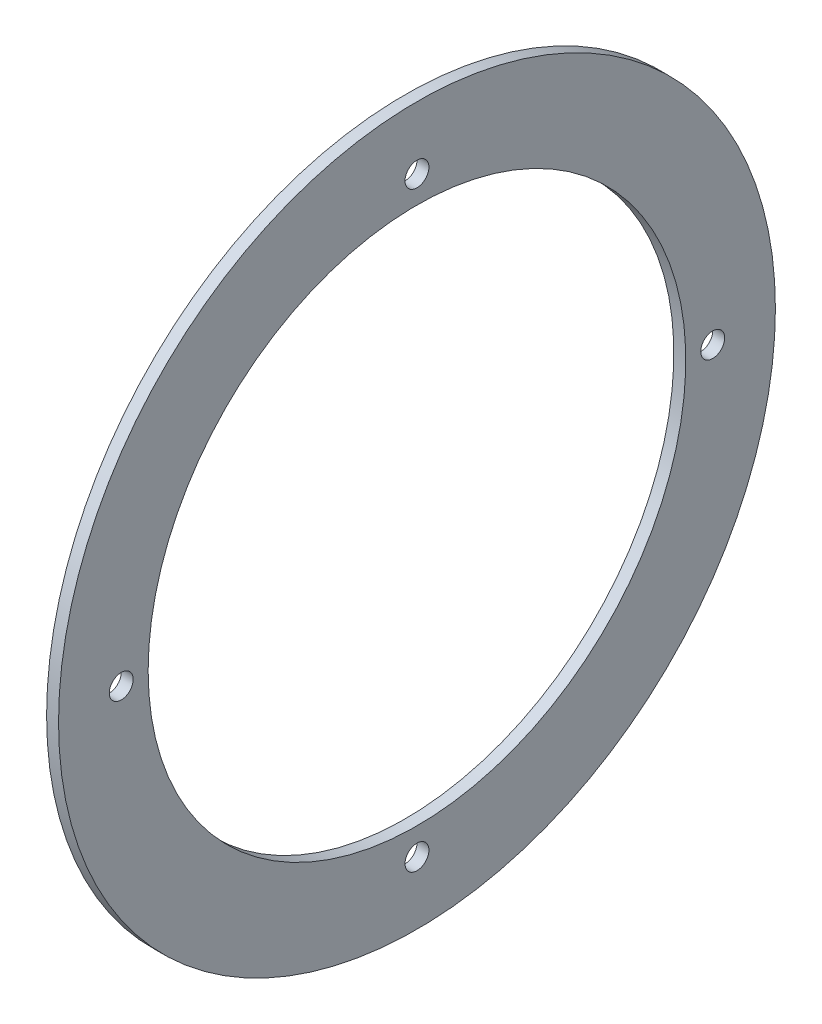
ISO-10303-21;
HEADER;
FILE_DESCRIPTION(('STEP AP214'),'2;1');
FILE_NAME('part.step','',(''),(''),'','','');
FILE_SCHEMA(('AUTOMOTIVE_DESIGN { 1 0 10303 214 1 1 1 1 }'));
ENDSEC;
DATA;
#1=APPLICATION_CONTEXT('core data for automotive mechanical design processes');
#2=APPLICATION_PROTOCOL_DEFINITION('international standard','automotive_design',2000,#1);
#3=PRODUCT_CONTEXT('',#1,'mechanical');
#4=PRODUCT('Part','Part','',(#3));
#5=PRODUCT_RELATED_PRODUCT_CATEGORY('part','',(#4));
#6=PRODUCT_DEFINITION_FORMATION('','',#4);
#7=PRODUCT_DEFINITION_CONTEXT('part definition',#1,'design');
#8=PRODUCT_DEFINITION('design','',#6,#7);
#9=PRODUCT_DEFINITION_SHAPE('','',#8);
#10=(LENGTH_UNIT() NAMED_UNIT(*) SI_UNIT(.MILLI.,.METRE.));
#11=(NAMED_UNIT(*) PLANE_ANGLE_UNIT() SI_UNIT($,.RADIAN.));
#12=(NAMED_UNIT(*) SI_UNIT($,.STERADIAN.) SOLID_ANGLE_UNIT());
#13=UNCERTAINTY_MEASURE_WITH_UNIT(LENGTH_MEASURE(1.E-05),#10,'distance_accuracy_value','');
#14=(GEOMETRIC_REPRESENTATION_CONTEXT(3) GLOBAL_UNCERTAINTY_ASSIGNED_CONTEXT((#13)) GLOBAL_UNIT_ASSIGNED_CONTEXT((#10,
#11,#12)) REPRESENTATION_CONTEXT('',''));
#15=CARTESIAN_POINT('',(0.,0.,0.));
#16=DIRECTION('',(0.,0.,1.));
#17=DIRECTION('',(1.,0.,0.));
#18=AXIS2_PLACEMENT_3D('',#15,#16,#17);
#19=CARTESIAN_POINT('',(2.,0.,0.));
#20=DIRECTION('',(1.,0.,0.));
#21=DIRECTION('',(0.,0.,-1.));
#22=AXIS2_PLACEMENT_3D('',#19,#20,#21);
#23=PLANE('',#22);
#24=CARTESIAN_POINT('',(2.,0.,0.));
#25=DIRECTION('',(-1.,0.,0.));
#26=DIRECTION('',(0.,0.,1.));
#27=AXIS2_PLACEMENT_3D('',#24,#25,#26);
#28=CIRCLE('',#27,60.);
#29=CARTESIAN_POINT('',(2.,0.,60.));
#30=VERTEX_POINT('',#29);
#31=EDGE_CURVE('E41',#30,#30,#28,.T.);
#32=ORIENTED_EDGE('',*,*,#31,.F.);
#33=EDGE_LOOP('',(#32));
#34=FACE_BOUND('',#33,.T.);
#35=CARTESIAN_POINT('',(2.,-49.5,0.));
#36=DIRECTION('',(-1.,0.,0.));
#37=DIRECTION('',(0.,0.,1.));
#38=AXIS2_PLACEMENT_3D('',#35,#36,#37);
#39=CIRCLE('',#38,2.);
#40=CARTESIAN_POINT('',(2.,-49.5,2.));
#41=VERTEX_POINT('',#40);
#42=EDGE_CURVE('E44',#41,#41,#39,.T.);
#43=ORIENTED_EDGE('',*,*,#42,.T.);
#44=EDGE_LOOP('',(#43));
#45=FACE_BOUND('',#44,.T.);
#46=CARTESIAN_POINT('',(2.,49.5,0.));
#47=DIRECTION('',(-1.,0.,0.));
#48=DIRECTION('',(0.,0.,1.));
#49=AXIS2_PLACEMENT_3D('',#46,#47,#48);
#50=CIRCLE('',#49,2.);
#51=CARTESIAN_POINT('',(2.,49.5,2.));
#52=VERTEX_POINT('',#51);
#53=EDGE_CURVE('E47',#52,#52,#50,.T.);
#54=ORIENTED_EDGE('',*,*,#53,.T.);
#55=EDGE_LOOP('',(#54));
#56=FACE_BOUND('',#55,.T.);
#57=CARTESIAN_POINT('',(2.,0.,0.));
#58=DIRECTION('',(-1.,0.,0.));
#59=DIRECTION('',(0.,0.,1.));
#60=AXIS2_PLACEMENT_3D('',#57,#58,#59);
#61=CIRCLE('',#60,45.);
#62=CARTESIAN_POINT('',(2.,0.,45.));
#63=VERTEX_POINT('',#62);
#64=EDGE_CURVE('E50',#63,#63,#61,.T.);
#65=ORIENTED_EDGE('',*,*,#64,.T.);
#66=EDGE_LOOP('',(#65));
#67=FACE_BOUND('',#66,.T.);
#68=CARTESIAN_POINT('',(2.,0.,49.5));
#69=DIRECTION('',(-1.,0.,0.));
#70=DIRECTION('',(0.,0.,1.));
#71=AXIS2_PLACEMENT_3D('',#68,#69,#70);
#72=CIRCLE('',#71,2.);
#73=CARTESIAN_POINT('',(2.,0.,51.5));
#74=VERTEX_POINT('',#73);
#75=EDGE_CURVE('E52',#74,#74,#72,.T.);
#76=ORIENTED_EDGE('',*,*,#75,.T.);
#77=EDGE_LOOP('',(#76));
#78=FACE_BOUND('',#77,.T.);
#79=CARTESIAN_POINT('',(2.,0.,-49.5));
#80=DIRECTION('',(-1.,0.,0.));
#81=DIRECTION('',(0.,0.,1.));
#82=AXIS2_PLACEMENT_3D('',#79,#80,#81);
#83=CIRCLE('',#82,2.);
#84=CARTESIAN_POINT('',(2.,0.,-47.5));
#85=VERTEX_POINT('',#84);
#86=EDGE_CURVE('E18',#85,#85,#83,.T.);
#87=ORIENTED_EDGE('',*,*,#86,.T.);
#88=EDGE_LOOP('',(#87));
#89=FACE_BOUND('',#88,.T.);
#90=ADVANCED_FACE('F15',(#34,#45,#56,#67,#78,#89),#23,.T.);
#91=CARTESIAN_POINT('',(2.,0.,-49.5));
#92=DIRECTION('',(-1.,0.,0.));
#93=DIRECTION('',(0.,0.,1.));
#94=AXIS2_PLACEMENT_3D('',#91,#92,#93);
#95=CYLINDRICAL_SURFACE('',#94,2.);
#96=CARTESIAN_POINT('',(0.,0.,-49.5));
#97=DIRECTION('',(-1.,0.,0.));
#98=DIRECTION('',(0.,0.,1.));
#99=AXIS2_PLACEMENT_3D('',#96,#97,#98);
#100=CIRCLE('',#99,2.);
#101=CARTESIAN_POINT('',(0.,0.,-47.5));
#102=VERTEX_POINT('',#101);
#103=EDGE_CURVE('E38',#102,#102,#100,.T.);
#104=ORIENTED_EDGE('',*,*,#103,.T.);
#105=EDGE_LOOP('',(#104));
#106=FACE_BOUND('',#105,.T.);
#107=ORIENTED_EDGE('',*,*,#86,.F.);
#108=EDGE_LOOP('',(#107));
#109=FACE_BOUND('',#108,.T.);
#110=ADVANCED_FACE('F60',(#106,#109),#95,.F.);
#111=CARTESIAN_POINT('',(2.,0.,49.5));
#112=DIRECTION('',(-1.,0.,0.));
#113=DIRECTION('',(0.,0.,1.));
#114=AXIS2_PLACEMENT_3D('',#111,#112,#113);
#115=CYLINDRICAL_SURFACE('',#114,2.);
#116=CARTESIAN_POINT('',(0.,0.,49.5));
#117=DIRECTION('',(-1.,0.,0.));
#118=DIRECTION('',(0.,0.,1.));
#119=AXIS2_PLACEMENT_3D('',#116,#117,#118);
#120=CIRCLE('',#119,2.);
#121=CARTESIAN_POINT('',(0.,0.,51.5));
#122=VERTEX_POINT('',#121);
#123=EDGE_CURVE('E35',#122,#122,#120,.T.);
#124=ORIENTED_EDGE('',*,*,#123,.T.);
#125=EDGE_LOOP('',(#124));
#126=FACE_BOUND('',#125,.T.);
#127=ORIENTED_EDGE('',*,*,#75,.F.);
#128=EDGE_LOOP('',(#127));
#129=FACE_BOUND('',#128,.T.);
#130=ADVANCED_FACE('F62',(#126,#129),#115,.F.);
#131=CARTESIAN_POINT('',(2.,0.,0.));
#132=DIRECTION('',(-1.,0.,0.));
#133=DIRECTION('',(0.,0.,1.));
#134=AXIS2_PLACEMENT_3D('',#131,#132,#133);
#135=CYLINDRICAL_SURFACE('',#134,45.);
#136=CARTESIAN_POINT('',(0.,0.,0.));
#137=DIRECTION('',(-1.,0.,0.));
#138=DIRECTION('',(0.,0.,1.));
#139=AXIS2_PLACEMENT_3D('',#136,#137,#138);
#140=CIRCLE('',#139,45.);
#141=CARTESIAN_POINT('',(0.,0.,45.));
#142=VERTEX_POINT('',#141);
#143=EDGE_CURVE('E32',#142,#142,#140,.T.);
#144=ORIENTED_EDGE('',*,*,#143,.T.);
#145=EDGE_LOOP('',(#144));
#146=FACE_BOUND('',#145,.T.);
#147=ORIENTED_EDGE('',*,*,#64,.F.);
#148=EDGE_LOOP('',(#147));
#149=FACE_BOUND('',#148,.T.);
#150=ADVANCED_FACE('F69',(#146,#149),#135,.F.);
#151=CARTESIAN_POINT('',(2.,49.5,0.));
#152=DIRECTION('',(-1.,0.,0.));
#153=DIRECTION('',(0.,0.,1.));
#154=AXIS2_PLACEMENT_3D('',#151,#152,#153);
#155=CYLINDRICAL_SURFACE('',#154,2.);
#156=CARTESIAN_POINT('',(0.,49.5,0.));
#157=DIRECTION('',(-1.,0.,0.));
#158=DIRECTION('',(0.,0.,1.));
#159=AXIS2_PLACEMENT_3D('',#156,#157,#158);
#160=CIRCLE('',#159,2.);
#161=CARTESIAN_POINT('',(0.,49.5,2.));
#162=VERTEX_POINT('',#161);
#163=EDGE_CURVE('E27',#162,#162,#160,.T.);
#164=ORIENTED_EDGE('',*,*,#163,.T.);
#165=EDGE_LOOP('',(#164));
#166=FACE_BOUND('',#165,.T.);
#167=ORIENTED_EDGE('',*,*,#53,.F.);
#168=EDGE_LOOP('',(#167));
#169=FACE_BOUND('',#168,.T.);
#170=ADVANCED_FACE('F88',(#166,#169),#155,.F.);
#171=CARTESIAN_POINT('',(2.,-49.5,0.));
#172=DIRECTION('',(-1.,0.,0.));
#173=DIRECTION('',(0.,0.,1.));
#174=AXIS2_PLACEMENT_3D('',#171,#172,#173);
#175=CYLINDRICAL_SURFACE('',#174,2.);
#176=CARTESIAN_POINT('',(0.,-49.5,0.));
#177=DIRECTION('',(-1.,0.,0.));
#178=DIRECTION('',(0.,0.,1.));
#179=AXIS2_PLACEMENT_3D('',#176,#177,#178);
#180=CIRCLE('',#179,2.);
#181=CARTESIAN_POINT('',(0.,-49.5,2.));
#182=VERTEX_POINT('',#181);
#183=EDGE_CURVE('E22',#182,#182,#180,.T.);
#184=ORIENTED_EDGE('',*,*,#183,.T.);
#185=EDGE_LOOP('',(#184));
#186=FACE_BOUND('',#185,.T.);
#187=ORIENTED_EDGE('',*,*,#42,.F.);
#188=EDGE_LOOP('',(#187));
#189=FACE_BOUND('',#188,.T.);
#190=ADVANCED_FACE('F81',(#186,#189),#175,.F.);
#191=CARTESIAN_POINT('',(2.,0.,0.));
#192=DIRECTION('',(-1.,0.,0.));
#193=DIRECTION('',(0.,0.,1.));
#194=AXIS2_PLACEMENT_3D('',#191,#192,#193);
#195=CYLINDRICAL_SURFACE('',#194,60.);
#196=ORIENTED_EDGE('',*,*,#31,.T.);
#197=EDGE_LOOP('',(#196));
#198=FACE_BOUND('',#197,.T.);
#199=CARTESIAN_POINT('',(0.,0.,0.));
#200=DIRECTION('',(-1.,0.,0.));
#201=DIRECTION('',(0.,0.,1.));
#202=AXIS2_PLACEMENT_3D('',#199,#200,#201);
#203=CIRCLE('',#202,60.);
#204=CARTESIAN_POINT('',(0.,0.,60.));
#205=VERTEX_POINT('',#204);
#206=EDGE_CURVE('E10',#205,#205,#203,.F.);
#207=ORIENTED_EDGE('',*,*,#206,.T.);
#208=EDGE_LOOP('',(#207));
#209=FACE_BOUND('',#208,.T.);
#210=ADVANCED_FACE('F75',(#198,#209),#195,.T.);
#211=CARTESIAN_POINT('',(0.,0.,0.));
#212=DIRECTION('',(1.,0.,0.));
#213=DIRECTION('',(0.,0.,-1.));
#214=AXIS2_PLACEMENT_3D('',#211,#212,#213);
#215=PLANE('',#214);
#216=ORIENTED_EDGE('',*,*,#206,.F.);
#217=EDGE_LOOP('',(#216));
#218=FACE_BOUND('',#217,.T.);
#219=ORIENTED_EDGE('',*,*,#183,.F.);
#220=EDGE_LOOP('',(#219));
#221=FACE_BOUND('',#220,.T.);
#222=ORIENTED_EDGE('',*,*,#163,.F.);
#223=EDGE_LOOP('',(#222));
#224=FACE_BOUND('',#223,.T.);
#225=ORIENTED_EDGE('',*,*,#143,.F.);
#226=EDGE_LOOP('',(#225));
#227=FACE_BOUND('',#226,.T.);
#228=ORIENTED_EDGE('',*,*,#123,.F.);
#229=EDGE_LOOP('',(#228));
#230=FACE_BOUND('',#229,.T.);
#231=ORIENTED_EDGE('',*,*,#103,.F.);
#232=EDGE_LOOP('',(#231));
#233=FACE_BOUND('',#232,.T.);
#234=ADVANCED_FACE('F73',(#218,#221,#224,#227,#230,#233),#215,.F.);
#235=CLOSED_SHELL('',(#90,#110,#130,#150,#170,#190,#210,#234));
#236=MANIFOLD_SOLID_BREP('B1',#235);
#237=ADVANCED_BREP_SHAPE_REPRESENTATION('',(#18,#236),#14);
#238=SHAPE_DEFINITION_REPRESENTATION(#9,#237);
ENDSEC;
END-ISO-10303-21;
